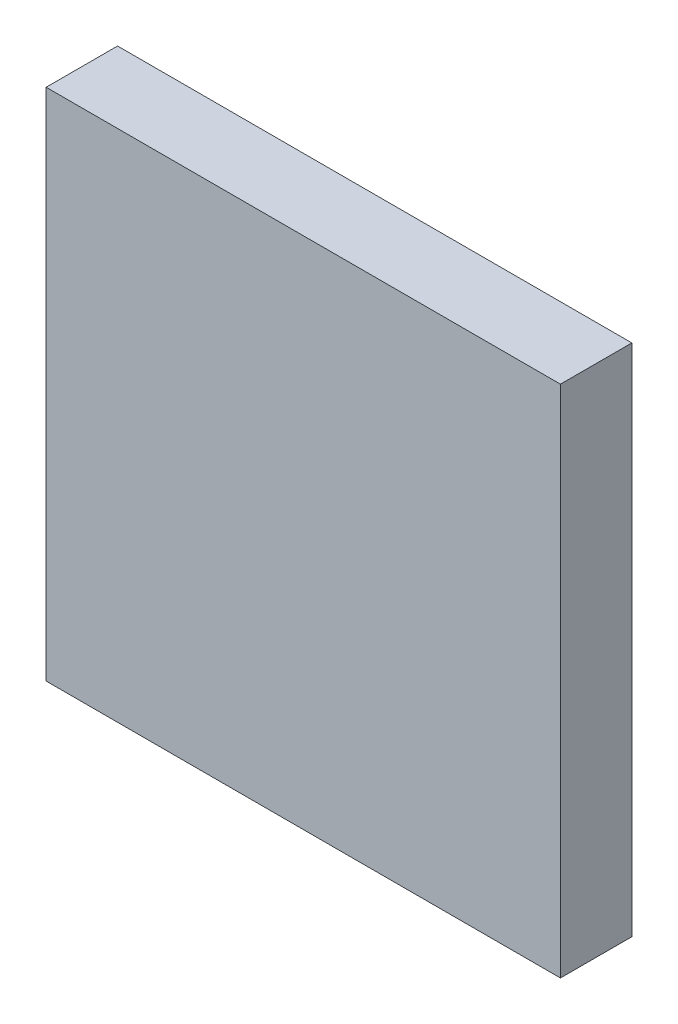
ISO-10303-21;
HEADER;
FILE_DESCRIPTION(('STEP AP214'),'2;1');
FILE_NAME('part.step','',(''),(''),'','','');
FILE_SCHEMA(('AUTOMOTIVE_DESIGN { 1 0 10303 214 1 1 1 1 }'));
ENDSEC;
DATA;
#1=APPLICATION_CONTEXT('core data for automotive mechanical design processes');
#2=APPLICATION_PROTOCOL_DEFINITION('international standard','automotive_design',2000,#1);
#3=PRODUCT_CONTEXT('',#1,'mechanical');
#4=PRODUCT('Part','Part','',(#3));
#5=PRODUCT_RELATED_PRODUCT_CATEGORY('part','',(#4));
#6=PRODUCT_DEFINITION_FORMATION('','',#4);
#7=PRODUCT_DEFINITION_CONTEXT('part definition',#1,'design');
#8=PRODUCT_DEFINITION('design','',#6,#7);
#9=PRODUCT_DEFINITION_SHAPE('','',#8);
#10=(LENGTH_UNIT() NAMED_UNIT(*) SI_UNIT(.MILLI.,.METRE.));
#11=(NAMED_UNIT(*) PLANE_ANGLE_UNIT() SI_UNIT($,.RADIAN.));
#12=(NAMED_UNIT(*) SI_UNIT($,.STERADIAN.) SOLID_ANGLE_UNIT());
#13=UNCERTAINTY_MEASURE_WITH_UNIT(LENGTH_MEASURE(1.E-05),#10,'distance_accuracy_value','');
#14=(GEOMETRIC_REPRESENTATION_CONTEXT(3) GLOBAL_UNCERTAINTY_ASSIGNED_CONTEXT((#13)) GLOBAL_UNIT_ASSIGNED_CONTEXT((#10,
#11,#12)) REPRESENTATION_CONTEXT('',''));
#15=CARTESIAN_POINT('',(0.,0.,0.));
#16=DIRECTION('',(0.,0.,1.));
#17=DIRECTION('',(1.,0.,0.));
#18=AXIS2_PLACEMENT_3D('',#15,#16,#17);
#19=CARTESIAN_POINT('',(5.4,5.4,0.25));
#20=DIRECTION('',(0.,1.,0.));
#21=DIRECTION('',(1.,0.,0.));
#22=AXIS2_PLACEMENT_3D('',#19,#20,#21);
#23=PLANE('',#22);
#24=DIRECTION('',(1.,0.,0.));
#25=VECTOR('',#24,1.);
#26=CARTESIAN_POINT('',(-5.4,5.4,0.25));
#27=LINE('',#26,#25);
#28=CARTESIAN_POINT('',(-5.4,5.4,0.25));
#29=VERTEX_POINT('',#28);
#30=CARTESIAN_POINT('',(5.4,5.4,0.25));
#31=VERTEX_POINT('',#30);
#32=EDGE_CURVE('E26',#29,#31,#27,.T.);
#33=ORIENTED_EDGE('',*,*,#32,.F.);
#34=DIRECTION('',(0.,0.,1.));
#35=VECTOR('',#34,1.);
#36=CARTESIAN_POINT('',(-5.4,5.4,0.25));
#37=LINE('',#36,#35);
#38=CARTESIAN_POINT('',(-5.4,5.4,1.75));
#39=VERTEX_POINT('',#38);
#40=EDGE_CURVE('E76',#29,#39,#37,.T.);
#41=ORIENTED_EDGE('',*,*,#40,.T.);
#42=DIRECTION('',(-1.,0.,0.));
#43=VECTOR('',#42,1.);
#44=CARTESIAN_POINT('',(-5.4,5.4,1.75));
#45=LINE('',#44,#43);
#46=CARTESIAN_POINT('',(5.4,5.4,1.75));
#47=VERTEX_POINT('',#46);
#48=EDGE_CURVE('E11',#47,#39,#45,.T.);
#49=ORIENTED_EDGE('',*,*,#48,.F.);
#50=DIRECTION('',(0.,0.,1.));
#51=VECTOR('',#50,1.);
#52=CARTESIAN_POINT('',(5.4,5.4,0.25));
#53=LINE('',#52,#51);
#54=EDGE_CURVE('E101',#31,#47,#53,.T.);
#55=ORIENTED_EDGE('',*,*,#54,.F.);
#56=EDGE_LOOP('',(#33,#41,#49,#55));
#57=FACE_BOUND('',#56,.T.);
#58=ADVANCED_FACE('F16',(#57),#23,.T.);
#59=CARTESIAN_POINT('',(0.,0.,1.75));
#60=DIRECTION('',(0.,0.,1.));
#61=DIRECTION('',(1.,0.,0.));
#62=AXIS2_PLACEMENT_3D('',#59,#60,#61);
#63=PLANE('',#62);
#64=ORIENTED_EDGE('',*,*,#48,.T.);
#65=DIRECTION('',(0.,-1.,0.));
#66=VECTOR('',#65,1.);
#67=CARTESIAN_POINT('',(-5.4,-5.4,1.75));
#68=LINE('',#67,#66);
#69=CARTESIAN_POINT('',(-5.4,-5.4,1.75));
#70=VERTEX_POINT('',#69);
#71=EDGE_CURVE('E78',#39,#70,#68,.T.);
#72=ORIENTED_EDGE('',*,*,#71,.T.);
#73=DIRECTION('',(1.,0.,0.));
#74=VECTOR('',#73,1.);
#75=CARTESIAN_POINT('',(5.4,-5.4,1.75));
#76=LINE('',#75,#74);
#77=CARTESIAN_POINT('',(5.4,-5.4,1.75));
#78=VERTEX_POINT('',#77);
#79=EDGE_CURVE('E87',#70,#78,#76,.T.);
#80=ORIENTED_EDGE('',*,*,#79,.T.);
#81=DIRECTION('',(0.,1.,0.));
#82=VECTOR('',#81,1.);
#83=CARTESIAN_POINT('',(5.4,5.4,1.75));
#84=LINE('',#83,#82);
#85=EDGE_CURVE('E79',#78,#47,#84,.T.);
#86=ORIENTED_EDGE('',*,*,#85,.T.);
#87=EDGE_LOOP('',(#64,#72,#80,#86));
#88=FACE_BOUND('',#87,.T.);
#89=ADVANCED_FACE('F18',(#88),#63,.T.);
#90=CARTESIAN_POINT('',(0.,0.,0.25));
#91=DIRECTION('',(0.,0.,1.));
#92=DIRECTION('',(1.,0.,0.));
#93=AXIS2_PLACEMENT_3D('',#90,#91,#92);
#94=PLANE('',#93);
#95=ORIENTED_EDGE('',*,*,#32,.T.);
#96=DIRECTION('',(0.,-1.,0.));
#97=VECTOR('',#96,1.);
#98=CARTESIAN_POINT('',(5.4,5.4,0.25));
#99=LINE('',#98,#97);
#100=CARTESIAN_POINT('',(5.4,-5.4,0.25));
#101=VERTEX_POINT('',#100);
#102=EDGE_CURVE('E62',#31,#101,#99,.T.);
#103=ORIENTED_EDGE('',*,*,#102,.T.);
#104=DIRECTION('',(-1.,0.,0.));
#105=VECTOR('',#104,1.);
#106=CARTESIAN_POINT('',(5.4,-5.4,0.25));
#107=LINE('',#106,#105);
#108=CARTESIAN_POINT('',(-5.4,-5.4,0.25));
#109=VERTEX_POINT('',#108);
#110=EDGE_CURVE('E85',#101,#109,#107,.T.);
#111=ORIENTED_EDGE('',*,*,#110,.T.);
#112=DIRECTION('',(0.,1.,0.));
#113=VECTOR('',#112,1.);
#114=CARTESIAN_POINT('',(-5.4,-5.4,0.25));
#115=LINE('',#114,#113);
#116=EDGE_CURVE('E70',#109,#29,#115,.T.);
#117=ORIENTED_EDGE('',*,*,#116,.T.);
#118=EDGE_LOOP('',(#95,#103,#111,#117));
#119=FACE_BOUND('',#118,.T.);
#120=ADVANCED_FACE('F90',(#119),#94,.F.);
#121=CARTESIAN_POINT('',(-5.4,5.4,0.25));
#122=DIRECTION('',(-1.,0.,0.));
#123=DIRECTION('',(0.,0.,1.));
#124=AXIS2_PLACEMENT_3D('',#121,#122,#123);
#125=PLANE('',#124);
#126=ORIENTED_EDGE('',*,*,#116,.F.);
#127=DIRECTION('',(0.,0.,1.));
#128=VECTOR('',#127,1.);
#129=CARTESIAN_POINT('',(-5.4,-5.4,0.25));
#130=LINE('',#129,#128);
#131=EDGE_CURVE('E74',#109,#70,#130,.T.);
#132=ORIENTED_EDGE('',*,*,#131,.T.);
#133=ORIENTED_EDGE('',*,*,#71,.F.);
#134=ORIENTED_EDGE('',*,*,#40,.F.);
#135=EDGE_LOOP('',(#126,#132,#133,#134));
#136=FACE_BOUND('',#135,.T.);
#137=ADVANCED_FACE('F72',(#136),#125,.T.);
#138=CARTESIAN_POINT('',(5.4,-5.4,0.25));
#139=DIRECTION('',(1.,0.,0.));
#140=DIRECTION('',(0.,1.,0.));
#141=AXIS2_PLACEMENT_3D('',#138,#139,#140);
#142=PLANE('',#141);
#143=ORIENTED_EDGE('',*,*,#102,.F.);
#144=ORIENTED_EDGE('',*,*,#54,.T.);
#145=ORIENTED_EDGE('',*,*,#85,.F.);
#146=DIRECTION('',(0.,0.,1.));
#147=VECTOR('',#146,1.);
#148=CARTESIAN_POINT('',(5.4,-5.4,0.25));
#149=LINE('',#148,#147);
#150=EDGE_CURVE('E92',#101,#78,#149,.T.);
#151=ORIENTED_EDGE('',*,*,#150,.F.);
#152=EDGE_LOOP('',(#143,#144,#145,#151));
#153=FACE_BOUND('',#152,.T.);
#154=ADVANCED_FACE('F119',(#153),#142,.T.);
#155=CARTESIAN_POINT('',(-5.4,-5.4,0.25));
#156=DIRECTION('',(0.,-1.,0.));
#157=DIRECTION('',(-1.,0.,0.));
#158=AXIS2_PLACEMENT_3D('',#155,#156,#157);
#159=PLANE('',#158);
#160=ORIENTED_EDGE('',*,*,#110,.F.);
#161=ORIENTED_EDGE('',*,*,#150,.T.);
#162=ORIENTED_EDGE('',*,*,#79,.F.);
#163=ORIENTED_EDGE('',*,*,#131,.F.);
#164=EDGE_LOOP('',(#160,#161,#162,#163));
#165=FACE_BOUND('',#164,.T.);
#166=ADVANCED_FACE('F83',(#165),#159,.T.);
#167=CLOSED_SHELL('',(#58,#89,#120,#137,#154,#166));
#168=MANIFOLD_SOLID_BREP('B1',#167);
#169=ADVANCED_BREP_SHAPE_REPRESENTATION('',(#18,#168),#14);
#170=SHAPE_DEFINITION_REPRESENTATION(#9,#169);
ENDSEC;
END-ISO-10303-21;
